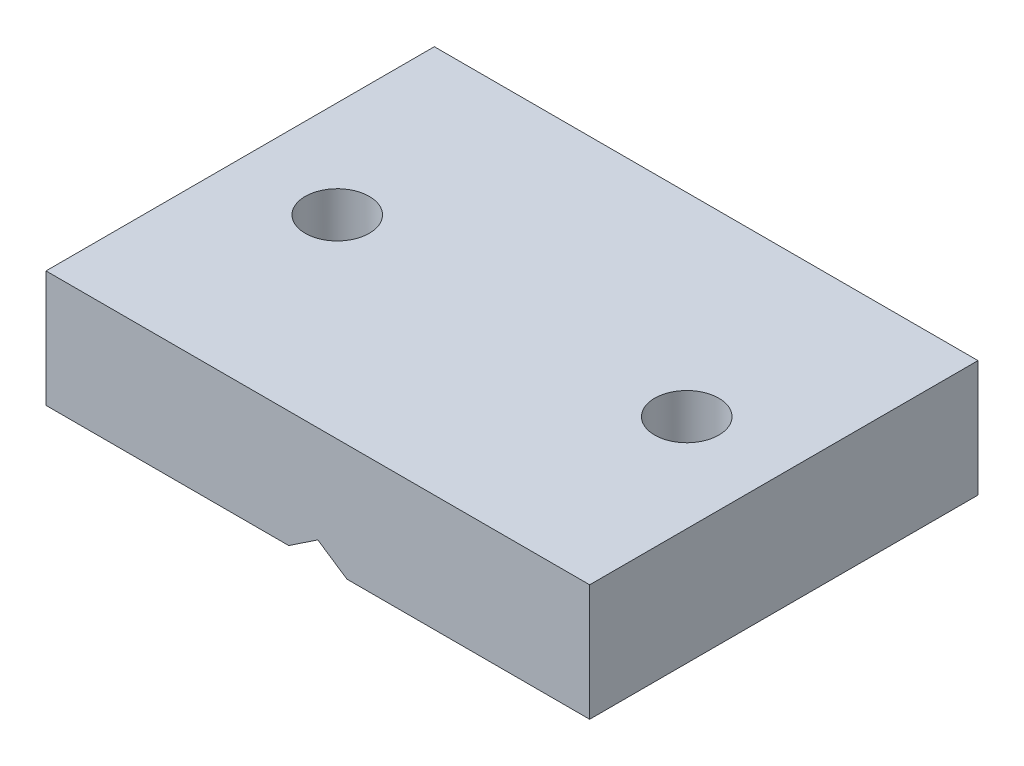
ISO-10303-21;
HEADER;
FILE_DESCRIPTION(('STEP AP214'),'2;1');
FILE_NAME('part.step','',(''),(''),'','','');
FILE_SCHEMA(('AUTOMOTIVE_DESIGN { 1 0 10303 214 1 1 1 1 }'));
ENDSEC;
DATA;
#1=APPLICATION_CONTEXT('core data for automotive mechanical design processes');
#2=APPLICATION_PROTOCOL_DEFINITION('international standard','automotive_design',2000,#1);
#3=PRODUCT_CONTEXT('',#1,'mechanical');
#4=PRODUCT('Part','Part','',(#3));
#5=PRODUCT_RELATED_PRODUCT_CATEGORY('part','',(#4));
#6=PRODUCT_DEFINITION_FORMATION('','',#4);
#7=PRODUCT_DEFINITION_CONTEXT('part definition',#1,'design');
#8=PRODUCT_DEFINITION('design','',#6,#7);
#9=PRODUCT_DEFINITION_SHAPE('','',#8);
#10=(LENGTH_UNIT() NAMED_UNIT(*) SI_UNIT(.MILLI.,.METRE.));
#11=(NAMED_UNIT(*) PLANE_ANGLE_UNIT() SI_UNIT($,.RADIAN.));
#12=(NAMED_UNIT(*) SI_UNIT($,.STERADIAN.) SOLID_ANGLE_UNIT());
#13=UNCERTAINTY_MEASURE_WITH_UNIT(LENGTH_MEASURE(1.E-05),#10,'distance_accuracy_value','');
#14=(GEOMETRIC_REPRESENTATION_CONTEXT(3) GLOBAL_UNCERTAINTY_ASSIGNED_CONTEXT((#13)) GLOBAL_UNIT_ASSIGNED_CONTEXT((#10,
#11,#12)) REPRESENTATION_CONTEXT('',''));
#15=CARTESIAN_POINT('',(0.,0.,0.));
#16=DIRECTION('',(0.,0.,1.));
#17=DIRECTION('',(1.,0.,0.));
#18=AXIS2_PLACEMENT_3D('',#15,#16,#17);
#19=CARTESIAN_POINT('',(0.,0.999999999999998,10.));
#20=DIRECTION('',(0.554700196225229,0.832050294337844,0.));
#21=DIRECTION('',(-0.832050294337844,0.554700196225229,0.));
#22=AXIS2_PLACEMENT_3D('',#19,#20,#21);
#23=PLANE('',#22);
#24=DIRECTION('',(0.832050294337844,-0.554700196225229,0.));
#25=VECTOR('',#24,1.);
#26=CARTESIAN_POINT('',(0.,0.999999999999998,-10.));
#27=LINE('',#26,#25);
#28=CARTESIAN_POINT('',(0.,0.999999999999998,-10.));
#29=VERTEX_POINT('',#28);
#30=CARTESIAN_POINT('',(1.5,0.,-10.));
#31=VERTEX_POINT('',#30);
#32=EDGE_CURVE('E124',#29,#31,#27,.T.);
#33=ORIENTED_EDGE('',*,*,#32,.T.);
#34=DIRECTION('',(0.,0.,-1.));
#35=VECTOR('',#34,1.);
#36=CARTESIAN_POINT('',(1.5,0.,10.));
#37=LINE('',#36,#35);
#38=CARTESIAN_POINT('',(1.5,0.,10.));
#39=VERTEX_POINT('',#38);
#40=EDGE_CURVE('E11',#39,#31,#37,.T.);
#41=ORIENTED_EDGE('',*,*,#40,.F.);
#42=DIRECTION('',(0.832050294337844,-0.554700196225229,0.));
#43=VECTOR('',#42,1.);
#44=CARTESIAN_POINT('',(0.,0.999999999999998,10.));
#45=LINE('',#44,#43);
#46=CARTESIAN_POINT('',(0.,0.999999999999998,10.));
#47=VERTEX_POINT('',#46);
#48=EDGE_CURVE('E137',#47,#39,#45,.T.);
#49=ORIENTED_EDGE('',*,*,#48,.F.);
#50=DIRECTION('',(0.,0.,-1.));
#51=VECTOR('',#50,1.);
#52=CARTESIAN_POINT('',(0.,0.999999999999998,10.));
#53=LINE('',#52,#51);
#54=EDGE_CURVE('E120',#47,#29,#53,.T.);
#55=ORIENTED_EDGE('',*,*,#54,.T.);
#56=EDGE_LOOP('',(#33,#41,#49,#55));
#57=FACE_BOUND('',#56,.T.);
#58=ADVANCED_FACE('F33',(#57),#23,.F.);
#59=CARTESIAN_POINT('',(14.,0.,10.));
#60=DIRECTION('',(0.,1.,0.));
#61=DIRECTION('',(0.,0.,1.));
#62=AXIS2_PLACEMENT_3D('',#59,#60,#61);
#63=PLANE('',#62);
#64=CARTESIAN_POINT('',(9.,0.,0.));
#65=DIRECTION('',(0.,-1.,0.));
#66=DIRECTION('',(-1.,0.,0.));
#67=AXIS2_PLACEMENT_3D('',#64,#65,#66);
#68=CIRCLE('',#67,1.65);
#69=CARTESIAN_POINT('',(7.35,0.,0.));
#70=VERTEX_POINT('',#69);
#71=EDGE_CURVE('E166',#70,#70,#68,.T.);
#72=ORIENTED_EDGE('',*,*,#71,.F.);
#73=EDGE_LOOP('',(#72));
#74=FACE_BOUND('',#73,.T.);
#75=DIRECTION('',(1.,0.,0.));
#76=VECTOR('',#75,1.);
#77=CARTESIAN_POINT('',(14.,0.,-10.));
#78=LINE('',#77,#76);
#79=CARTESIAN_POINT('',(14.,0.,-10.));
#80=VERTEX_POINT('',#79);
#81=EDGE_CURVE('E127',#31,#80,#78,.T.);
#82=ORIENTED_EDGE('',*,*,#81,.T.);
#83=DIRECTION('',(0.,0.,-1.));
#84=VECTOR('',#83,1.);
#85=CARTESIAN_POINT('',(14.,0.,10.));
#86=LINE('',#85,#84);
#87=CARTESIAN_POINT('',(14.,0.,10.));
#88=VERTEX_POINT('',#87);
#89=EDGE_CURVE('E42',#88,#80,#86,.T.);
#90=ORIENTED_EDGE('',*,*,#89,.F.);
#91=DIRECTION('',(1.,0.,0.));
#92=VECTOR('',#91,1.);
#93=CARTESIAN_POINT('',(14.,0.,10.));
#94=LINE('',#93,#92);
#95=EDGE_CURVE('E90',#39,#88,#94,.T.);
#96=ORIENTED_EDGE('',*,*,#95,.F.);
#97=ORIENTED_EDGE('',*,*,#40,.T.);
#98=EDGE_LOOP('',(#82,#90,#96,#97));
#99=FACE_BOUND('',#98,.T.);
#100=ADVANCED_FACE('F185',(#74,#99),#63,.F.);
#101=CARTESIAN_POINT('',(14.,6.,10.));
#102=DIRECTION('',(-1.,0.,0.));
#103=DIRECTION('',(0.,-1.,0.));
#104=AXIS2_PLACEMENT_3D('',#101,#102,#103);
#105=PLANE('',#104);
#106=DIRECTION('',(0.,1.,0.));
#107=VECTOR('',#106,1.);
#108=CARTESIAN_POINT('',(14.,6.,-10.));
#109=LINE('',#108,#107);
#110=CARTESIAN_POINT('',(14.,6.,-10.));
#111=VERTEX_POINT('',#110);
#112=EDGE_CURVE('E130',#80,#111,#109,.T.);
#113=ORIENTED_EDGE('',*,*,#112,.T.);
#114=DIRECTION('',(0.,0.,-1.));
#115=VECTOR('',#114,1.);
#116=CARTESIAN_POINT('',(14.,6.,10.));
#117=LINE('',#116,#115);
#118=CARTESIAN_POINT('',(14.,6.,10.));
#119=VERTEX_POINT('',#118);
#120=EDGE_CURVE('E141',#119,#111,#117,.T.);
#121=ORIENTED_EDGE('',*,*,#120,.F.);
#122=DIRECTION('',(0.,1.,0.));
#123=VECTOR('',#122,1.);
#124=CARTESIAN_POINT('',(14.,6.,10.));
#125=LINE('',#124,#123);
#126=EDGE_CURVE('E150',#88,#119,#125,.T.);
#127=ORIENTED_EDGE('',*,*,#126,.F.);
#128=ORIENTED_EDGE('',*,*,#89,.T.);
#129=EDGE_LOOP('',(#113,#121,#127,#128));
#130=FACE_BOUND('',#129,.T.);
#131=ADVANCED_FACE('F148',(#130),#105,.F.);
#132=CARTESIAN_POINT('',(-14.,6.,10.));
#133=DIRECTION('',(0.,-1.,0.));
#134=DIRECTION('',(0.,0.,-1.));
#135=AXIS2_PLACEMENT_3D('',#132,#133,#134);
#136=PLANE('',#135);
#137=CARTESIAN_POINT('',(9.,6.,0.));
#138=DIRECTION('',(0.,-1.,0.));
#139=DIRECTION('',(0.,0.,-1.));
#140=AXIS2_PLACEMENT_3D('',#137,#138,#139);
#141=CIRCLE('',#140,1.65);
#142=CARTESIAN_POINT('',(9.,6.,-1.65));
#143=VERTEX_POINT('',#142);
#144=EDGE_CURVE('E36',#143,#143,#141,.T.);
#145=ORIENTED_EDGE('',*,*,#144,.T.);
#146=EDGE_LOOP('',(#145));
#147=FACE_BOUND('',#146,.T.);
#148=CARTESIAN_POINT('',(-9.,6.,0.));
#149=DIRECTION('',(0.,-1.,0.));
#150=DIRECTION('',(0.,0.,-1.));
#151=AXIS2_PLACEMENT_3D('',#148,#149,#150);
#152=CIRCLE('',#151,1.65);
#153=CARTESIAN_POINT('',(-9.,6.,-1.65));
#154=VERTEX_POINT('',#153);
#155=EDGE_CURVE('E128',#154,#154,#152,.T.);
#156=ORIENTED_EDGE('',*,*,#155,.T.);
#157=EDGE_LOOP('',(#156));
#158=FACE_BOUND('',#157,.T.);
#159=DIRECTION('',(-1.,0.,0.));
#160=VECTOR('',#159,1.);
#161=CARTESIAN_POINT('',(-14.,6.,-10.));
#162=LINE('',#161,#160);
#163=CARTESIAN_POINT('',(-14.,6.,-10.));
#164=VERTEX_POINT('',#163);
#165=EDGE_CURVE('E132',#111,#164,#162,.T.);
#166=ORIENTED_EDGE('',*,*,#165,.T.);
#167=DIRECTION('',(0.,0.,-1.));
#168=VECTOR('',#167,1.);
#169=CARTESIAN_POINT('',(-14.,6.,10.));
#170=LINE('',#169,#168);
#171=CARTESIAN_POINT('',(-14.,6.,10.));
#172=VERTEX_POINT('',#171);
#173=EDGE_CURVE('E115',#172,#164,#170,.T.);
#174=ORIENTED_EDGE('',*,*,#173,.F.);
#175=DIRECTION('',(-1.,0.,0.));
#176=VECTOR('',#175,1.);
#177=CARTESIAN_POINT('',(-14.,6.,10.));
#178=LINE('',#177,#176);
#179=EDGE_CURVE('E106',#119,#172,#178,.T.);
#180=ORIENTED_EDGE('',*,*,#179,.F.);
#181=ORIENTED_EDGE('',*,*,#120,.T.);
#182=EDGE_LOOP('',(#166,#174,#180,#181));
#183=FACE_BOUND('',#182,.T.);
#184=ADVANCED_FACE('F156',(#147,#158,#183),#136,.F.);
#185=CARTESIAN_POINT('',(-14.,0.,10.));
#186=DIRECTION('',(1.,0.,0.));
#187=DIRECTION('',(0.,0.,-1.));
#188=AXIS2_PLACEMENT_3D('',#185,#186,#187);
#189=PLANE('',#188);
#190=DIRECTION('',(0.,-1.,0.));
#191=VECTOR('',#190,1.);
#192=CARTESIAN_POINT('',(-14.,0.,-10.));
#193=LINE('',#192,#191);
#194=CARTESIAN_POINT('',(-14.,0.,-10.));
#195=VERTEX_POINT('',#194);
#196=EDGE_CURVE('E114',#164,#195,#193,.T.);
#197=ORIENTED_EDGE('',*,*,#196,.T.);
#198=DIRECTION('',(0.,0.,-1.));
#199=VECTOR('',#198,1.);
#200=CARTESIAN_POINT('',(-14.,0.,10.));
#201=LINE('',#200,#199);
#202=CARTESIAN_POINT('',(-14.,0.,10.));
#203=VERTEX_POINT('',#202);
#204=EDGE_CURVE('E111',#203,#195,#201,.T.);
#205=ORIENTED_EDGE('',*,*,#204,.F.);
#206=DIRECTION('',(0.,-1.,0.));
#207=VECTOR('',#206,1.);
#208=CARTESIAN_POINT('',(-14.,0.,10.));
#209=LINE('',#208,#207);
#210=EDGE_CURVE('E100',#172,#203,#209,.T.);
#211=ORIENTED_EDGE('',*,*,#210,.F.);
#212=ORIENTED_EDGE('',*,*,#173,.T.);
#213=EDGE_LOOP('',(#197,#205,#211,#212));
#214=FACE_BOUND('',#213,.T.);
#215=ADVANCED_FACE('F112',(#214),#189,.F.);
#216=CARTESIAN_POINT('',(-1.5,0.,10.));
#217=DIRECTION('',(0.,1.,0.));
#218=DIRECTION('',(0.,0.,1.));
#219=AXIS2_PLACEMENT_3D('',#216,#217,#218);
#220=PLANE('',#219);
#221=CARTESIAN_POINT('',(-9.,0.,0.));
#222=DIRECTION('',(0.,-1.,0.));
#223=DIRECTION('',(1.,0.,0.));
#224=AXIS2_PLACEMENT_3D('',#221,#222,#223);
#225=CIRCLE('',#224,1.65);
#226=CARTESIAN_POINT('',(-7.35,0.,0.));
#227=VERTEX_POINT('',#226);
#228=EDGE_CURVE('E163',#227,#227,#225,.T.);
#229=ORIENTED_EDGE('',*,*,#228,.F.);
#230=EDGE_LOOP('',(#229));
#231=FACE_BOUND('',#230,.T.);
#232=DIRECTION('',(1.,0.,0.));
#233=VECTOR('',#232,1.);
#234=CARTESIAN_POINT('',(-1.5,0.,-10.));
#235=LINE('',#234,#233);
#236=CARTESIAN_POINT('',(-1.5,0.,-10.));
#237=VERTEX_POINT('',#236);
#238=EDGE_CURVE('E76',#195,#237,#235,.T.);
#239=ORIENTED_EDGE('',*,*,#238,.T.);
#240=DIRECTION('',(0.,0.,-1.));
#241=VECTOR('',#240,1.);
#242=CARTESIAN_POINT('',(-1.5,0.,10.));
#243=LINE('',#242,#241);
#244=CARTESIAN_POINT('',(-1.5,0.,10.));
#245=VERTEX_POINT('',#244);
#246=EDGE_CURVE('E116',#245,#237,#243,.T.);
#247=ORIENTED_EDGE('',*,*,#246,.F.);
#248=DIRECTION('',(1.,0.,0.));
#249=VECTOR('',#248,1.);
#250=CARTESIAN_POINT('',(-1.5,0.,10.));
#251=LINE('',#250,#249);
#252=EDGE_CURVE('E104',#203,#245,#251,.T.);
#253=ORIENTED_EDGE('',*,*,#252,.F.);
#254=ORIENTED_EDGE('',*,*,#204,.T.);
#255=EDGE_LOOP('',(#239,#247,#253,#254));
#256=FACE_BOUND('',#255,.T.);
#257=ADVANCED_FACE('F118',(#231,#256),#220,.F.);
#258=CARTESIAN_POINT('',(-1.5,0.,10.));
#259=DIRECTION('',(-0.554700196225229,0.832050294337844,0.));
#260=DIRECTION('',(-0.832050294337844,-0.554700196225229,0.));
#261=AXIS2_PLACEMENT_3D('',#258,#259,#260);
#262=PLANE('',#261);
#263=DIRECTION('',(0.832050294337844,0.554700196225229,0.));
#264=VECTOR('',#263,1.);
#265=CARTESIAN_POINT('',(-1.5,0.,-10.));
#266=LINE('',#265,#264);
#267=EDGE_CURVE('E82',#237,#29,#266,.T.);
#268=ORIENTED_EDGE('',*,*,#267,.T.);
#269=ORIENTED_EDGE('',*,*,#54,.F.);
#270=DIRECTION('',(0.832050294337844,0.554700196225229,0.));
#271=VECTOR('',#270,1.);
#272=CARTESIAN_POINT('',(-1.5,0.,10.));
#273=LINE('',#272,#271);
#274=EDGE_CURVE('E50',#245,#47,#273,.T.);
#275=ORIENTED_EDGE('',*,*,#274,.F.);
#276=ORIENTED_EDGE('',*,*,#246,.T.);
#277=EDGE_LOOP('',(#268,#269,#275,#276));
#278=FACE_BOUND('',#277,.T.);
#279=ADVANCED_FACE('F193',(#278),#262,.F.);
#280=CARTESIAN_POINT('',(0.,0.,10.));
#281=DIRECTION('',(0.,0.,1.));
#282=DIRECTION('',(1.,0.,0.));
#283=AXIS2_PLACEMENT_3D('',#280,#281,#282);
#284=PLANE('',#283);
#285=ORIENTED_EDGE('',*,*,#48,.T.);
#286=ORIENTED_EDGE('',*,*,#95,.T.);
#287=ORIENTED_EDGE('',*,*,#126,.T.);
#288=ORIENTED_EDGE('',*,*,#179,.T.);
#289=ORIENTED_EDGE('',*,*,#210,.T.);
#290=ORIENTED_EDGE('',*,*,#252,.T.);
#291=ORIENTED_EDGE('',*,*,#274,.T.);
#292=EDGE_LOOP('',(#285,#286,#287,#288,#289,#290,#291));
#293=FACE_BOUND('',#292,.T.);
#294=ADVANCED_FACE('F102',(#293),#284,.T.);
#295=CARTESIAN_POINT('',(0.,0.,-10.));
#296=DIRECTION('',(0.,0.,1.));
#297=DIRECTION('',(1.,0.,0.));
#298=AXIS2_PLACEMENT_3D('',#295,#296,#297);
#299=PLANE('',#298);
#300=ORIENTED_EDGE('',*,*,#32,.F.);
#301=ORIENTED_EDGE('',*,*,#267,.F.);
#302=ORIENTED_EDGE('',*,*,#238,.F.);
#303=ORIENTED_EDGE('',*,*,#196,.F.);
#304=ORIENTED_EDGE('',*,*,#165,.F.);
#305=ORIENTED_EDGE('',*,*,#112,.F.);
#306=ORIENTED_EDGE('',*,*,#81,.F.);
#307=EDGE_LOOP('',(#300,#301,#302,#303,#304,#305,#306));
#308=FACE_BOUND('',#307,.T.);
#309=ADVANCED_FACE('F154',(#308),#299,.F.);
#310=CARTESIAN_POINT('',(-9.,15.,0.));
#311=DIRECTION('',(0.,-1.,0.));
#312=DIRECTION('',(1.,0.,0.));
#313=AXIS2_PLACEMENT_3D('',#310,#311,#312);
#314=CYLINDRICAL_SURFACE('',#313,1.65);
#315=ORIENTED_EDGE('',*,*,#228,.T.);
#316=EDGE_LOOP('',(#315));
#317=FACE_BOUND('',#316,.T.);
#318=ORIENTED_EDGE('',*,*,#155,.F.);
#319=EDGE_LOOP('',(#318));
#320=FACE_BOUND('',#319,.T.);
#321=ADVANCED_FACE('F177',(#317,#320),#314,.F.);
#322=CARTESIAN_POINT('',(9.,15.,0.));
#323=DIRECTION('',(0.,-1.,0.));
#324=DIRECTION('',(1.,0.,0.));
#325=AXIS2_PLACEMENT_3D('',#322,#323,#324);
#326=CYLINDRICAL_SURFACE('',#325,1.65);
#327=ORIENTED_EDGE('',*,*,#71,.T.);
#328=EDGE_LOOP('',(#327));
#329=FACE_BOUND('',#328,.T.);
#330=ORIENTED_EDGE('',*,*,#144,.F.);
#331=EDGE_LOOP('',(#330));
#332=FACE_BOUND('',#331,.T.);
#333=ADVANCED_FACE('F175',(#329,#332),#326,.F.);
#334=CLOSED_SHELL('',(#58,#100,#131,#184,#215,#257,#279,#294,#309,#321,#333));
#335=MANIFOLD_SOLID_BREP('B2',#334);
#336=ADVANCED_BREP_SHAPE_REPRESENTATION('',(#18,#335),#14);
#337=SHAPE_DEFINITION_REPRESENTATION(#9,#336);
ENDSEC;
END-ISO-10303-21;
